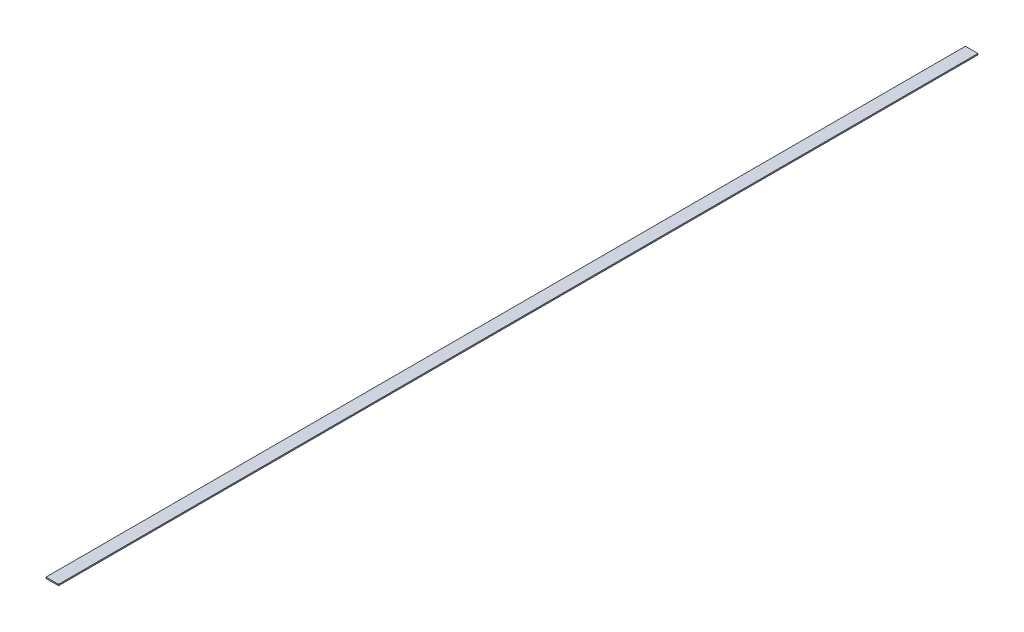
ISO-10303-21;
HEADER;
FILE_DESCRIPTION(('STEP AP214'),'2;1');
FILE_NAME('part.step','',(''),(''),'','','');
FILE_SCHEMA(('AUTOMOTIVE_DESIGN { 1 0 10303 214 1 1 1 1 }'));
ENDSEC;
DATA;
#1=APPLICATION_CONTEXT('core data for automotive mechanical design processes');
#2=APPLICATION_PROTOCOL_DEFINITION('international standard','automotive_design',2000,#1);
#3=PRODUCT_CONTEXT('',#1,'mechanical');
#4=PRODUCT('Part','Part','',(#3));
#5=PRODUCT_RELATED_PRODUCT_CATEGORY('part','',(#4));
#6=PRODUCT_DEFINITION_FORMATION('','',#4);
#7=PRODUCT_DEFINITION_CONTEXT('part definition',#1,'design');
#8=PRODUCT_DEFINITION('design','',#6,#7);
#9=PRODUCT_DEFINITION_SHAPE('','',#8);
#10=(LENGTH_UNIT() NAMED_UNIT(*) SI_UNIT(.MILLI.,.METRE.));
#11=(NAMED_UNIT(*) PLANE_ANGLE_UNIT() SI_UNIT($,.RADIAN.));
#12=(NAMED_UNIT(*) SI_UNIT($,.STERADIAN.) SOLID_ANGLE_UNIT());
#13=UNCERTAINTY_MEASURE_WITH_UNIT(LENGTH_MEASURE(1.E-05),#10,'distance_accuracy_value','');
#14=(GEOMETRIC_REPRESENTATION_CONTEXT(3) GLOBAL_UNCERTAINTY_ASSIGNED_CONTEXT((#13)) GLOBAL_UNIT_ASSIGNED_CONTEXT((#10,
#11,#12)) REPRESENTATION_CONTEXT('',''));
#15=CARTESIAN_POINT('',(0.,0.,0.));
#16=DIRECTION('',(0.,0.,1.));
#17=DIRECTION('',(1.,0.,0.));
#18=AXIS2_PLACEMENT_3D('',#15,#16,#17);
#19=CARTESIAN_POINT('',(-50.7999999999998,5.08,0.));
#20=DIRECTION('',(0.,0.,-1.));
#21=DIRECTION('',(-1.,0.,0.));
#22=AXIS2_PLACEMENT_3D('',#19,#20,#21);
#23=PLANE('',#22);
#24=DIRECTION('',(1.,0.,0.));
#25=VECTOR('',#24,1.);
#26=CARTESIAN_POINT('',(-50.7999999999998,0.,0.));
#27=LINE('',#26,#25);
#28=CARTESIAN_POINT('',(-50.7999999999998,0.,0.));
#29=VERTEX_POINT('',#28);
#30=CARTESIAN_POINT('',(0.,0.,0.));
#31=VERTEX_POINT('',#30);
#32=EDGE_CURVE('E107',#29,#31,#27,.T.);
#33=ORIENTED_EDGE('',*,*,#32,.T.);
#34=DIRECTION('',(0.,-1.,0.));
#35=VECTOR('',#34,1.);
#36=CARTESIAN_POINT('',(0.,5.08,0.));
#37=LINE('',#36,#35);
#38=CARTESIAN_POINT('',(0.,5.08,0.));
#39=VERTEX_POINT('',#38);
#40=EDGE_CURVE('E11',#39,#31,#37,.T.);
#41=ORIENTED_EDGE('',*,*,#40,.F.);
#42=DIRECTION('',(1.,0.,0.));
#43=VECTOR('',#42,1.);
#44=CARTESIAN_POINT('',(-50.7999999999998,5.08,0.));
#45=LINE('',#44,#43);
#46=CARTESIAN_POINT('',(-50.7999999999998,5.08,0.));
#47=VERTEX_POINT('',#46);
#48=EDGE_CURVE('E90',#47,#39,#45,.T.);
#49=ORIENTED_EDGE('',*,*,#48,.F.);
#50=DIRECTION('',(0.,-1.,0.));
#51=VECTOR('',#50,1.);
#52=CARTESIAN_POINT('',(-50.7999999999998,5.08,0.));
#53=LINE('',#52,#51);
#54=EDGE_CURVE('E103',#47,#29,#53,.T.);
#55=ORIENTED_EDGE('',*,*,#54,.T.);
#56=EDGE_LOOP('',(#33,#41,#49,#55));
#57=FACE_BOUND('',#56,.T.);
#58=ADVANCED_FACE('F38',(#57),#23,.F.);
#59=CARTESIAN_POINT('',(0.,5.08,0.));
#60=DIRECTION('',(-1.,0.,0.));
#61=DIRECTION('',(0.,0.,1.));
#62=AXIS2_PLACEMENT_3D('',#59,#60,#61);
#63=PLANE('',#62);
#64=DIRECTION('',(0.,0.,-1.));
#65=VECTOR('',#64,1.);
#66=CARTESIAN_POINT('',(0.,0.,0.));
#67=LINE('',#66,#65);
#68=CARTESIAN_POINT('',(0.,0.,-3721.1));
#69=VERTEX_POINT('',#68);
#70=EDGE_CURVE('E95',#31,#69,#67,.T.);
#71=ORIENTED_EDGE('',*,*,#70,.T.);
#72=DIRECTION('',(0.,-1.,0.));
#73=VECTOR('',#72,1.);
#74=CARTESIAN_POINT('',(0.,5.08,-3721.1));
#75=LINE('',#74,#73);
#76=CARTESIAN_POINT('',(0.,5.08,-3721.1));
#77=VERTEX_POINT('',#76);
#78=EDGE_CURVE('E47',#77,#69,#75,.T.);
#79=ORIENTED_EDGE('',*,*,#78,.F.);
#80=DIRECTION('',(0.,0.,-1.));
#81=VECTOR('',#80,1.);
#82=CARTESIAN_POINT('',(0.,5.08,0.));
#83=LINE('',#82,#81);
#84=EDGE_CURVE('E85',#39,#77,#83,.T.);
#85=ORIENTED_EDGE('',*,*,#84,.F.);
#86=ORIENTED_EDGE('',*,*,#40,.T.);
#87=EDGE_LOOP('',(#71,#79,#85,#86));
#88=FACE_BOUND('',#87,.T.);
#89=ADVANCED_FACE('F94',(#88),#63,.F.);
#90=CARTESIAN_POINT('',(0.,5.08,-3721.1));
#91=DIRECTION('',(0.,0.,1.));
#92=DIRECTION('',(1.,0.,0.));
#93=AXIS2_PLACEMENT_3D('',#90,#91,#92);
#94=PLANE('',#93);
#95=DIRECTION('',(-1.,0.,0.));
#96=VECTOR('',#95,1.);
#97=CARTESIAN_POINT('',(0.,0.,-3721.1));
#98=LINE('',#97,#96);
#99=CARTESIAN_POINT('',(-50.8,0.,-3721.1));
#100=VERTEX_POINT('',#99);
#101=EDGE_CURVE('E72',#69,#100,#98,.T.);
#102=ORIENTED_EDGE('',*,*,#101,.T.);
#103=DIRECTION('',(0.,-1.,0.));
#104=VECTOR('',#103,1.);
#105=CARTESIAN_POINT('',(-50.8,5.08,-3721.1));
#106=LINE('',#105,#104);
#107=CARTESIAN_POINT('',(-50.8,5.08,-3721.1));
#108=VERTEX_POINT('',#107);
#109=EDGE_CURVE('E97',#108,#100,#106,.T.);
#110=ORIENTED_EDGE('',*,*,#109,.F.);
#111=DIRECTION('',(-1.,0.,0.));
#112=VECTOR('',#111,1.);
#113=CARTESIAN_POINT('',(0.,5.08,-3721.1));
#114=LINE('',#113,#112);
#115=EDGE_CURVE('E88',#77,#108,#114,.T.);
#116=ORIENTED_EDGE('',*,*,#115,.F.);
#117=ORIENTED_EDGE('',*,*,#78,.T.);
#118=EDGE_LOOP('',(#102,#110,#116,#117));
#119=FACE_BOUND('',#118,.T.);
#120=ADVANCED_FACE('F98',(#119),#94,.F.);
#121=CARTESIAN_POINT('',(-50.8,5.08,-3721.1));
#122=DIRECTION('',(1.,0.,0.));
#123=DIRECTION('',(0.,0.,-1.));
#124=AXIS2_PLACEMENT_3D('',#121,#122,#123);
#125=PLANE('',#124);
#126=DIRECTION('',(0.,0.,1.));
#127=VECTOR('',#126,1.);
#128=CARTESIAN_POINT('',(-50.8,0.,-3721.1));
#129=LINE('',#128,#127);
#130=EDGE_CURVE('E78',#100,#29,#129,.T.);
#131=ORIENTED_EDGE('',*,*,#130,.T.);
#132=ORIENTED_EDGE('',*,*,#54,.F.);
#133=DIRECTION('',(0.,0.,1.));
#134=VECTOR('',#133,1.);
#135=CARTESIAN_POINT('',(-50.8,5.08,-3721.1));
#136=LINE('',#135,#134);
#137=EDGE_CURVE('E55',#108,#47,#136,.T.);
#138=ORIENTED_EDGE('',*,*,#137,.F.);
#139=ORIENTED_EDGE('',*,*,#109,.T.);
#140=EDGE_LOOP('',(#131,#132,#138,#139));
#141=FACE_BOUND('',#140,.T.);
#142=ADVANCED_FACE('F120',(#141),#125,.F.);
#143=CARTESIAN_POINT('',(0.,5.08,0.));
#144=DIRECTION('',(0.,1.,0.));
#145=DIRECTION('',(0.,0.,1.));
#146=AXIS2_PLACEMENT_3D('',#143,#144,#145);
#147=PLANE('',#146);
#148=ORIENTED_EDGE('',*,*,#48,.T.);
#149=ORIENTED_EDGE('',*,*,#84,.T.);
#150=ORIENTED_EDGE('',*,*,#115,.T.);
#151=ORIENTED_EDGE('',*,*,#137,.T.);
#152=EDGE_LOOP('',(#148,#149,#150,#151));
#153=FACE_BOUND('',#152,.T.);
#154=ADVANCED_FACE('F86',(#153),#147,.T.);
#155=CARTESIAN_POINT('',(0.,0.,0.));
#156=DIRECTION('',(0.,1.,0.));
#157=DIRECTION('',(0.,0.,1.));
#158=AXIS2_PLACEMENT_3D('',#155,#156,#157);
#159=PLANE('',#158);
#160=ORIENTED_EDGE('',*,*,#32,.F.);
#161=ORIENTED_EDGE('',*,*,#130,.F.);
#162=ORIENTED_EDGE('',*,*,#101,.F.);
#163=ORIENTED_EDGE('',*,*,#70,.F.);
#164=EDGE_LOOP('',(#160,#161,#162,#163));
#165=FACE_BOUND('',#164,.T.);
#166=ADVANCED_FACE('F123',(#165),#159,.F.);
#167=CLOSED_SHELL('',(#58,#89,#120,#142,#154,#166));
#168=MANIFOLD_SOLID_BREP('B2',#167);
#169=ADVANCED_BREP_SHAPE_REPRESENTATION('',(#18,#168),#14);
#170=SHAPE_DEFINITION_REPRESENTATION(#9,#169);
ENDSEC;
END-ISO-10303-21;
